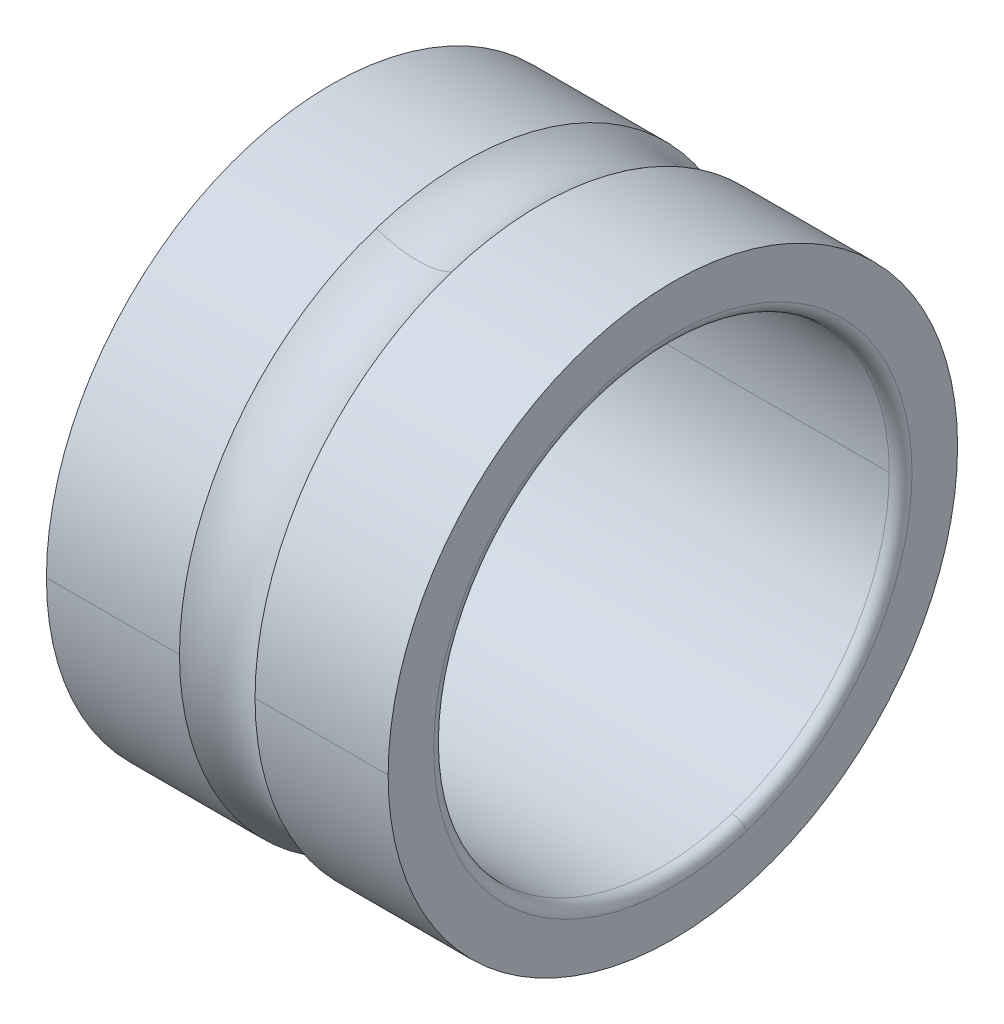
ISO-10303-21;
HEADER;
FILE_DESCRIPTION(('STEP AP214'),'2;1');
FILE_NAME('part.step','',(''),(''),'','','');
FILE_SCHEMA(('AUTOMOTIVE_DESIGN { 1 0 10303 214 1 1 1 1 }'));
ENDSEC;
DATA;
#1=APPLICATION_CONTEXT('core data for automotive mechanical design processes');
#2=APPLICATION_PROTOCOL_DEFINITION('international standard','automotive_design',2000,#1);
#3=PRODUCT_CONTEXT('',#1,'mechanical');
#4=PRODUCT('Part','Part','',(#3));
#5=PRODUCT_RELATED_PRODUCT_CATEGORY('part','',(#4));
#6=PRODUCT_DEFINITION_FORMATION('','',#4);
#7=PRODUCT_DEFINITION_CONTEXT('part definition',#1,'design');
#8=PRODUCT_DEFINITION('design','',#6,#7);
#9=PRODUCT_DEFINITION_SHAPE('','',#8);
#10=(LENGTH_UNIT() NAMED_UNIT(*) SI_UNIT(.MILLI.,.METRE.));
#11=(NAMED_UNIT(*) PLANE_ANGLE_UNIT() SI_UNIT($,.RADIAN.));
#12=(NAMED_UNIT(*) SI_UNIT($,.STERADIAN.) SOLID_ANGLE_UNIT());
#13=UNCERTAINTY_MEASURE_WITH_UNIT(LENGTH_MEASURE(1.E-05),#10,'distance_accuracy_value','');
#14=(GEOMETRIC_REPRESENTATION_CONTEXT(3) GLOBAL_UNCERTAINTY_ASSIGNED_CONTEXT((#13)) GLOBAL_UNIT_ASSIGNED_CONTEXT((#10,
#11,#12)) REPRESENTATION_CONTEXT('',''));
#15=CARTESIAN_POINT('',(0.,0.,0.));
#16=DIRECTION('',(0.,0.,1.));
#17=DIRECTION('',(1.,0.,0.));
#18=AXIS2_PLACEMENT_3D('',#15,#16,#17);
#19=CARTESIAN_POINT('',(0.,2.5,0.));
#20=DIRECTION('',(-1.,0.,0.));
#21=DIRECTION('',(0.,0.,1.));
#22=AXIS2_PLACEMENT_3D('',#19,#20,#21);
#23=PLANE('',#22);
#24=CARTESIAN_POINT('',(0.,0.,0.));
#25=DIRECTION('',(1.,0.,0.));
#26=DIRECTION('',(0.,0.,-1.));
#27=AXIS2_PLACEMENT_3D('',#24,#25,#26);
#28=CIRCLE('',#27,2.1);
#29=CARTESIAN_POINT('',(0.,1.99721868421975,0.648935688187366));
#30=VERTEX_POINT('',#29);
#31=CARTESIAN_POINT('',(0.,-1.99721868421975,-0.648935688187366));
#32=VERTEX_POINT('',#31);
#33=EDGE_CURVE('E11',#30,#32,#28,.T.);
#34=ORIENTED_EDGE('',*,*,#33,.T.);
#35=CARTESIAN_POINT('',(0.,-1.99721868421982,-0.648935688187389));
#36=CARTESIAN_POINT('',(0.,-1.79315843574684,-1.27610142852603));
#37=CARTESIAN_POINT('',(0.,-1.34391082026572,-1.82492631831534));
#38=CARTESIAN_POINT('',(0.,-0.686083016260852,-2.15925279936392));
#39=CARTESIAN_POINT('',(0.,0.728797998933005,-2.24300960324237));
#40=CARTESIAN_POINT('',(0.,1.8242297711444,-1.34360273103063));
#41=CARTESIAN_POINT('',(0.,2.15991146894551,-0.686465444450743));
#42=CARTESIAN_POINT('',(0.,2.20076924824294,0.0216043413321269));
#43=CARTESIAN_POINT('',(0.,1.99721868421982,0.648935688187389));
#44=B_SPLINE_CURVE_WITH_KNOTS('',5,(#35,#36,#37,#38,#39,#40,#41,#42,#43),.UNSPECIFIED.,.F.,.F.,
(6,3,6),(0.,1.5707963267949,3.14159265358979),.UNSPECIFIED.);
#45=EDGE_CURVE('E26',#32,#30,#44,.T.);
#46=ORIENTED_EDGE('',*,*,#45,.T.);
#47=EDGE_LOOP('',(#34,#46));
#48=FACE_BOUND('',#47,.T.);
#49=CARTESIAN_POINT('',(0.,0.,0.));
#50=DIRECTION('',(1.,0.,0.));
#51=DIRECTION('',(0.,0.,-1.));
#52=AXIS2_PLACEMENT_3D('',#49,#50,#51);
#53=CIRCLE('',#52,2.5);
#54=CARTESIAN_POINT('',(0.,0.,2.5));
#55=VERTEX_POINT('',#54);
#56=CARTESIAN_POINT('',(0.,0.,-2.5));
#57=VERTEX_POINT('',#56);
#58=EDGE_CURVE('E318',#55,#57,#53,.T.);
#59=ORIENTED_EDGE('',*,*,#58,.F.);
#60=CARTESIAN_POINT('',(0.,0.,0.));
#61=DIRECTION('',(1.,0.,0.));
#62=DIRECTION('',(0.,0.,-1.));
#63=AXIS2_PLACEMENT_3D('',#60,#61,#62);
#64=CIRCLE('',#63,2.5);
#65=EDGE_CURVE('E313',#57,#55,#64,.T.);
#66=ORIENTED_EDGE('',*,*,#65,.F.);
#67=EDGE_LOOP('',(#59,#66));
#68=FACE_BOUND('',#67,.T.);
#69=ADVANCED_FACE('F17',(#48,#68),#23,.T.);
#70=CARTESIAN_POINT('',(3.,0.,0.));
#71=DIRECTION('',(1.,0.,0.));
#72=DIRECTION('',(0.,-1.,0.));
#73=AXIS2_PLACEMENT_3D('',#70,#71,#72);
#74=CYLINDRICAL_SURFACE('',#73,2.5);
#75=DIRECTION('',(1.,0.,0.));
#76=VECTOR('',#75,1.);
#77=CARTESIAN_POINT('',(0.,0.,2.5));
#78=LINE('',#77,#76);
#79=CARTESIAN_POINT('',(1.1683375209645,0.,2.5));
#80=VERTEX_POINT('',#79);
#81=EDGE_CURVE('E309',#55,#80,#78,.T.);
#82=ORIENTED_EDGE('',*,*,#81,.T.);
#83=CARTESIAN_POINT('',(1.1683375209645,0.,0.));
#84=DIRECTION('',(1.,0.,0.));
#85=DIRECTION('',(0.,0.,-1.));
#86=AXIS2_PLACEMENT_3D('',#83,#84,#85);
#87=CIRCLE('',#86,2.5);
#88=CARTESIAN_POINT('',(1.1683375209645,2.37764129073788,0.772542485937368));
#89=VERTEX_POINT('',#88);
#90=EDGE_CURVE('E304',#89,#80,#87,.T.);
#91=ORIENTED_EDGE('',*,*,#90,.F.);
#92=CARTESIAN_POINT('',(1.1683375209645,0.,0.));
#93=DIRECTION('',(1.,0.,0.));
#94=DIRECTION('',(0.,0.,-1.));
#95=AXIS2_PLACEMENT_3D('',#92,#93,#94);
#96=CIRCLE('',#95,2.5);
#97=CARTESIAN_POINT('',(1.1683375209645,0.,-2.5));
#98=VERTEX_POINT('',#97);
#99=EDGE_CURVE('E299',#98,#89,#96,.T.);
#100=ORIENTED_EDGE('',*,*,#99,.F.);
#101=DIRECTION('',(1.,0.,0.));
#102=VECTOR('',#101,1.);
#103=CARTESIAN_POINT('',(0.,0.,-2.5));
#104=LINE('',#103,#102);
#105=EDGE_CURVE('E294',#57,#98,#104,.T.);
#106=ORIENTED_EDGE('',*,*,#105,.F.);
#107=ORIENTED_EDGE('',*,*,#65,.T.);
#108=EDGE_LOOP('',(#82,#91,#100,#106,#107));
#109=FACE_BOUND('',#108,.T.);
#110=ADVANCED_FACE('F339',(#109),#74,.T.);
#111=CARTESIAN_POINT('',(3.,0.,0.));
#112=DIRECTION('',(1.,0.,0.));
#113=DIRECTION('',(0.,1.,0.));
#114=AXIS2_PLACEMENT_3D('',#111,#112,#113);
#115=CYLINDRICAL_SURFACE('',#114,2.5);
#116=ORIENTED_EDGE('',*,*,#81,.F.);
#117=ORIENTED_EDGE('',*,*,#58,.T.);
#118=ORIENTED_EDGE('',*,*,#105,.T.);
#119=CARTESIAN_POINT('',(1.1683375209645,0.,0.));
#120=DIRECTION('',(1.,0.,0.));
#121=DIRECTION('',(0.,0.,-1.));
#122=AXIS2_PLACEMENT_3D('',#119,#120,#121);
#123=CIRCLE('',#122,2.5);
#124=CARTESIAN_POINT('',(1.1683375209645,-2.37764129073788,-0.772542485937368));
#125=VERTEX_POINT('',#124);
#126=EDGE_CURVE('E289',#125,#98,#123,.T.);
#127=ORIENTED_EDGE('',*,*,#126,.F.);
#128=CARTESIAN_POINT('',(1.1683375209645,0.,0.));
#129=DIRECTION('',(1.,0.,0.));
#130=DIRECTION('',(0.,0.,-1.));
#131=AXIS2_PLACEMENT_3D('',#128,#129,#130);
#132=CIRCLE('',#131,2.5);
#133=EDGE_CURVE('E284',#80,#125,#132,.T.);
#134=ORIENTED_EDGE('',*,*,#133,.F.);
#135=EDGE_LOOP('',(#116,#117,#118,#127,#134));
#136=FACE_BOUND('',#135,.T.);
#137=ADVANCED_FACE('F334',(#136),#115,.T.);
#138=CARTESIAN_POINT('',(1.5,0.,0.));
#139=DIRECTION('',(1.,0.,0.));
#140=DIRECTION('',(0.,0.309016994374947,-0.951056516295154));
#141=AXIS2_PLACEMENT_3D('',#138,#139,#140);
#142=TOROIDAL_SURFACE('',#141,2.99999999999986,0.599999999999866);
#143=CARTESIAN_POINT('',(1.5,-2.85316954888533,-0.9270509831248));
#144=DIRECTION('',(0.,0.309016994374947,-0.951056516295154));
#145=DIRECTION('',(-0.552770798392623,0.792547096912593,0.257514161979111));
#146=AXIS2_PLACEMENT_3D('',#143,#144,#145);
#147=CIRCLE('',#146,0.599999999999866);
#148=CARTESIAN_POINT('',(1.8316624790355,-2.37764129073788,-0.772542485937368));
#149=VERTEX_POINT('',#148);
#150=EDGE_CURVE('E280',#125,#149,#147,.T.);
#151=ORIENTED_EDGE('',*,*,#150,.T.);
#152=CARTESIAN_POINT('',(1.8316624790355,0.,0.));
#153=DIRECTION('',(1.,0.,0.));
#154=DIRECTION('',(0.,0.,-1.));
#155=AXIS2_PLACEMENT_3D('',#152,#153,#154);
#156=CIRCLE('',#155,2.5);
#157=CARTESIAN_POINT('',(1.8316624790355,0.,2.5));
#158=VERTEX_POINT('',#157);
#159=EDGE_CURVE('E275',#158,#149,#156,.T.);
#160=ORIENTED_EDGE('',*,*,#159,.F.);
#161=CARTESIAN_POINT('',(1.8316624790355,0.,0.));
#162=DIRECTION('',(1.,0.,0.));
#163=DIRECTION('',(0.,0.,-1.));
#164=AXIS2_PLACEMENT_3D('',#161,#162,#163);
#165=CIRCLE('',#164,2.5);
#166=CARTESIAN_POINT('',(1.8316624790355,2.37764129073788,0.772542485937368));
#167=VERTEX_POINT('',#166);
#168=EDGE_CURVE('E270',#167,#158,#165,.T.);
#169=ORIENTED_EDGE('',*,*,#168,.F.);
#170=CARTESIAN_POINT('',(1.5,2.85316954888533,0.9270509831248));
#171=DIRECTION('',(0.,-0.309016994374947,0.951056516295154));
#172=DIRECTION('',(-0.552770798392623,-0.792547096912593,-0.257514161979111));
#173=AXIS2_PLACEMENT_3D('',#170,#171,#172);
#174=CIRCLE('',#173,0.599999999999866);
#175=EDGE_CURVE('E265',#89,#167,#174,.T.);
#176=ORIENTED_EDGE('',*,*,#175,.F.);
#177=ORIENTED_EDGE('',*,*,#90,.T.);
#178=ORIENTED_EDGE('',*,*,#133,.T.);
#179=EDGE_LOOP('',(#151,#160,#169,#176,#177,#178));
#180=FACE_BOUND('',#179,.T.);
#181=ADVANCED_FACE('F346',(#180),#142,.F.);
#182=CARTESIAN_POINT('',(1.5,0.,0.));
#183=DIRECTION('',(1.,0.,0.));
#184=DIRECTION('',(0.,-0.309016994374947,0.951056516295154));
#185=AXIS2_PLACEMENT_3D('',#182,#183,#184);
#186=TOROIDAL_SURFACE('',#185,2.99999999999986,0.599999999999866);
#187=ORIENTED_EDGE('',*,*,#150,.F.);
#188=ORIENTED_EDGE('',*,*,#126,.T.);
#189=ORIENTED_EDGE('',*,*,#99,.T.);
#190=ORIENTED_EDGE('',*,*,#175,.T.);
#191=CARTESIAN_POINT('',(1.8316624790355,0.,0.));
#192=DIRECTION('',(1.,0.,0.));
#193=DIRECTION('',(0.,0.,-1.));
#194=AXIS2_PLACEMENT_3D('',#191,#192,#193);
#195=CIRCLE('',#194,2.5);
#196=CARTESIAN_POINT('',(1.8316624790355,0.,-2.5));
#197=VERTEX_POINT('',#196);
#198=EDGE_CURVE('E260',#197,#167,#195,.T.);
#199=ORIENTED_EDGE('',*,*,#198,.F.);
#200=CARTESIAN_POINT('',(1.8316624790355,0.,0.));
#201=DIRECTION('',(1.,0.,0.));
#202=DIRECTION('',(0.,0.,-1.));
#203=AXIS2_PLACEMENT_3D('',#200,#201,#202);
#204=CIRCLE('',#203,2.5);
#205=EDGE_CURVE('E255',#149,#197,#204,.T.);
#206=ORIENTED_EDGE('',*,*,#205,.F.);
#207=EDGE_LOOP('',(#187,#188,#189,#190,#199,#206));
#208=FACE_BOUND('',#207,.T.);
#209=ADVANCED_FACE('F343',(#208),#186,.F.);
#210=CARTESIAN_POINT('',(3.,0.,0.));
#211=DIRECTION('',(1.,0.,0.));
#212=DIRECTION('',(0.,1.,0.));
#213=AXIS2_PLACEMENT_3D('',#210,#211,#212);
#214=CYLINDRICAL_SURFACE('',#213,2.5);
#215=DIRECTION('',(1.,0.,0.));
#216=VECTOR('',#215,1.);
#217=CARTESIAN_POINT('',(1.8316624790355,0.,2.5));
#218=LINE('',#217,#216);
#219=CARTESIAN_POINT('',(3.,0.,2.5));
#220=VERTEX_POINT('',#219);
#221=EDGE_CURVE('E250',#158,#220,#218,.T.);
#222=ORIENTED_EDGE('',*,*,#221,.F.);
#223=ORIENTED_EDGE('',*,*,#159,.T.);
#224=ORIENTED_EDGE('',*,*,#205,.T.);
#225=DIRECTION('',(1.,0.,0.));
#226=VECTOR('',#225,1.);
#227=CARTESIAN_POINT('',(1.8316624790355,0.,-2.5));
#228=LINE('',#227,#226);
#229=CARTESIAN_POINT('',(3.,0.,-2.5));
#230=VERTEX_POINT('',#229);
#231=EDGE_CURVE('E246',#197,#230,#228,.T.);
#232=ORIENTED_EDGE('',*,*,#231,.T.);
#233=CARTESIAN_POINT('',(3.,0.,0.));
#234=DIRECTION('',(1.,0.,0.));
#235=DIRECTION('',(0.,0.,-1.));
#236=AXIS2_PLACEMENT_3D('',#233,#234,#235);
#237=CIRCLE('',#236,2.5);
#238=EDGE_CURVE('E241',#220,#230,#237,.T.);
#239=ORIENTED_EDGE('',*,*,#238,.F.);
#240=EDGE_LOOP('',(#222,#223,#224,#232,#239));
#241=FACE_BOUND('',#240,.T.);
#242=ADVANCED_FACE('F353',(#241),#214,.T.);
#243=CARTESIAN_POINT('',(3.,2.1,0.));
#244=DIRECTION('',(1.,0.,0.));
#245=DIRECTION('',(0.,0.,-1.));
#246=AXIS2_PLACEMENT_3D('',#243,#244,#245);
#247=PLANE('',#246);
#248=CARTESIAN_POINT('',(3.,0.,0.));
#249=DIRECTION('',(1.,0.,0.));
#250=DIRECTION('',(0.,0.,-1.));
#251=AXIS2_PLACEMENT_3D('',#248,#249,#250);
#252=CIRCLE('',#251,2.5);
#253=EDGE_CURVE('E238',#230,#220,#252,.T.);
#254=ORIENTED_EDGE('',*,*,#253,.T.);
#255=ORIENTED_EDGE('',*,*,#238,.T.);
#256=EDGE_LOOP('',(#254,#255));
#257=FACE_BOUND('',#256,.T.);
#258=CARTESIAN_POINT('',(3.,-1.99721868421967,-0.648935688187345));
#259=CARTESIAN_POINT('',(3.,-1.98660118134118,-0.681615360728426));
#260=CARTESIAN_POINT('',(3.,-1.97518026238297,-0.714033922348104));
#261=CARTESIAN_POINT('',(3.,-1.95076210129556,-0.77827186302954));
#262=CARTESIAN_POINT('',(3.,-1.93776485916635,-0.810091242091297));
#263=CARTESIAN_POINT('',(3.,-1.91022456072533,-0.873053856941777));
#264=CARTESIAN_POINT('',(3.,-1.89568150441353,-0.904197092730499));
#265=CARTESIAN_POINT('',(3.,-1.86508482813472,-0.965732475988335));
#266=CARTESIAN_POINT('',(3.,-1.84903120816771,-0.99612462345745));
#267=CARTESIAN_POINT('',(3.,-1.81545202153776,-1.05608459082961));
#268=CARTESIAN_POINT('',(3.,-1.79792645487483,-1.08565241073266));
#269=CARTESIAN_POINT('',(3.,-1.76144561091669,-1.14389249737312));
#270=CARTESIAN_POINT('',(3.,-1.7424903336215,-1.17256476411052));
#271=CARTESIAN_POINT('',(3.,-1.7031957291854,-1.22894466884528));
#272=CARTESIAN_POINT('',(3.,-1.6828564020445,-1.25665230684264));
#273=CARTESIAN_POINT('',(3.,-1.64084269824602,-1.31103620439181));
#274=CARTESIAN_POINT('',(3.,-1.61916832158845,-1.33771246394361));
#275=CARTESIAN_POINT('',(3.,-1.57453673393144,-1.38996933904296));
#276=CARTESIAN_POINT('',(3.,-1.55157952293201,-1.4155499545905));
#277=CARTESIAN_POINT('',(3.,-1.50443757260298,-1.4655539157681));
#278=CARTESIAN_POINT('',(3.,-1.48025283327338,-1.48997726139817));
#279=CARTESIAN_POINT('',(3.,-1.43071408941807,-1.53760784475387));
#280=CARTESIAN_POINT('',(3.,-1.40536008489237,-1.5608150824795));
#281=CARTESIAN_POINT('',(3.,-1.3535438906682,-1.60595754176012));
#282=CARTESIAN_POINT('',(3.,-1.32708170096975,-1.6278927633151));
#283=CARTESIAN_POINT('',(3.,-1.27311288613136,-1.67043834638379));
#284=CARTESIAN_POINT('',(3.,-1.24560626099143,-1.69104870789751));
#285=CARTESIAN_POINT('',(3.,-1.18961484113975,-1.7308949187177));
#286=CARTESIAN_POINT('',(3.,-1.161130046428,-1.75013076802417));
#287=CARTESIAN_POINT('',(3.,-1.10325090979803,-1.78718161358398));
#288=CARTESIAN_POINT('',(3.,-1.0738565678798,-1.80499660983732));
#289=CARTESIAN_POINT('',(3.,-1.0142291503812,-1.8391628314045));
#290=CARTESIAN_POINT('',(3.,-0.983996074800828,-1.85551405671834));
#291=CARTESIAN_POINT('',(3.,-0.922764024105125,-1.88671334487253));
#292=CARTESIAN_POINT('',(3.,-0.891765048989791,-1.90156140771289));
#293=CARTESIAN_POINT('',(3.,-0.8290758784704,-1.9297186006362));
#294=CARTESIAN_POINT('',(3.,-0.797385683066344,-1.94302773071915));
#295=CARTESIAN_POINT('',(3.,-0.73339041642597,-1.96807499526754));
#296=CARTESIAN_POINT('',(3.,-0.701085345189653,-1.97981312973298));
#297=CARTESIAN_POINT('',(3.,-0.635938152630957,-2.00169012485227));
#298=CARTESIAN_POINT('',(3.,-0.603096031308577,-2.01182898550613));
#299=CARTESIAN_POINT('',(3.,-0.536953858124651,-2.03048300759889));
#300=CARTESIAN_POINT('',(3.,-0.503653806263105,-2.03899816903779));
#301=CARTESIAN_POINT('',(3.,-0.43667599474252,-2.05438427893089));
#302=CARTESIAN_POINT('',(3.,-0.402998235083482,-2.0612552273851));
#303=CARTESIAN_POINT('',(3.,-0.335346140640755,-2.07333635859214));
#304=CARTESIAN_POINT('',(3.,-0.301371805857066,-2.07854654134499));
#305=CARTESIAN_POINT('',(3.,-0.233208408313332,-2.08729358936273));
#306=CARTESIAN_POINT('',(3.,-0.199019345553287,-2.09083045462762));
#307=CARTESIAN_POINT('',(3.,-0.130508856503638,-2.09622234705121));
#308=CARTESIAN_POINT('',(3.,-0.0961874302140345,-2.09807737420992));
#309=CARTESIAN_POINT('',(3.,-0.0274948974274021,-2.10010112149826));
#310=CARTESIAN_POINT('',(3.,0.0068762090696264,-2.10026984162788));
#311=CARTESIAN_POINT('',(3.,0.0755852992650046,-2.09892056839648));
#312=CARTESIAN_POINT('',(3.,0.109923282963354,-2.09740257503545));
#313=CARTESIAN_POINT('',(3.,0.178483404350992,-2.09268353180171));
#314=CARTESIAN_POINT('',(3.,0.212705542040281,-2.08948248192899));
#315=CARTESIAN_POINT('',(3.,0.280951527282598,-2.08140503728139));
#316=CARTESIAN_POINT('',(3.,0.314975374835626,-2.07652864250651));
#317=CARTESIAN_POINT('',(3.,0.382742813376533,-2.06511225571672));
#318=CARTESIAN_POINT('',(3.,0.41648640436441,-2.05857226370181));
#319=CARTESIAN_POINT('',(3.,0.483612038508733,-2.04384443784555));
#320=CARTESIAN_POINT('',(3.,0.516994081665179,-2.03565660400421));
#321=CARTESIAN_POINT('',(3.,0.583316199880754,-2.01765281970399));
#322=CARTESIAN_POINT('',(3.,0.616256274939883,-2.00783686924511));
#323=CARTESIAN_POINT('',(3.,0.681615101434796,-1.98660049919424));
#324=CARTESIAN_POINT('',(3.,0.714033852870581,-1.97518007960226));
#325=CARTESIAN_POINT('',(3.,0.778271932507051,-1.95076228407628));
#326=CARTESIAN_POINT('',(3.,0.810091260707736,-1.9377649081423));
#327=CARTESIAN_POINT('',(3.,0.873053838325327,-1.91022451174939));
#328=CARTESIAN_POINT('',(3.,0.904197087742232,-1.89568149129047));
#329=CARTESIAN_POINT('',(3.,0.965732480976592,-1.86508484125779));
#330=CARTESIAN_POINT('',(3.,0.996124624794046,-1.84903121168403));
#331=CARTESIAN_POINT('',(3.,1.05608458949301,-1.81545201802145));
#332=CARTESIAN_POINT('',(3.,1.08565241037452,-1.79792645393264));
#333=CARTESIAN_POINT('',(3.,1.14389249773125,-1.76144561185889));
#334=CARTESIAN_POINT('',(3.,1.17256476420648,-1.74249033387396));
#335=CARTESIAN_POINT('',(3.,1.22894466874931,-1.70319572893294));
#336=CARTESIAN_POINT('',(3.,1.25665230681692,-1.68285640197686));
#337=CARTESIAN_POINT('',(3.,1.31103620441751,-1.64084269831367));
#338=CARTESIAN_POINT('',(3.,1.3377124639505,-1.61916832160658));
#339=CARTESIAN_POINT('',(3.,1.38996933903607,-1.57453673391332));
#340=CARTESIAN_POINT('',(3.,1.41554995458865,-1.55157952292716));
#341=CARTESIAN_POINT('',(3.,1.46555391576994,-1.50443757260784));
#342=CARTESIAN_POINT('',(3.,1.48997726139866,-1.48025283327469));
#343=CARTESIAN_POINT('',(3.,1.53760784475337,-1.43071408941678));
#344=CARTESIAN_POINT('',(3.,1.56081508247937,-1.40536008489202));
#345=CARTESIAN_POINT('',(3.,1.60595754176025,-1.35354389066856));
#346=CARTESIAN_POINT('',(3.,1.62789276331513,-1.32708170096985));
#347=CARTESIAN_POINT('',(3.,1.67043834638375,-1.27311288613127));
#348=CARTESIAN_POINT('',(3.,1.6910487078975,-1.24560626099141));
#349=CARTESIAN_POINT('',(3.,1.7308949187177,-1.18961484113978));
#350=CARTESIAN_POINT('',(3.,1.75013076802417,-1.16113004642802));
#351=CARTESIAN_POINT('',(3.,1.78718161358397,-1.10325090979803));
#352=CARTESIAN_POINT('',(3.,1.80499660983731,-1.0738565678798));
#353=CARTESIAN_POINT('',(3.,1.8391628314045,-1.0142291503812));
#354=CARTESIAN_POINT('',(3.,1.85551405671834,-0.983996074800835));
#355=CARTESIAN_POINT('',(3.,1.88671334487253,-0.922764024105131));
#356=CARTESIAN_POINT('',(3.,1.90156140771288,-0.891765048989797));
#357=CARTESIAN_POINT('',(3.,1.92971860063619,-0.829075878470405));
#358=CARTESIAN_POINT('',(3.,1.94302773071915,-0.797385683066348));
#359=CARTESIAN_POINT('',(3.,1.96807499526753,-0.733390416425978));
#360=CARTESIAN_POINT('',(3.,1.97981312973295,-0.701085345189666));
#361=CARTESIAN_POINT('',(3.,2.0016901248523,-0.635938152630955));
#362=CARTESIAN_POINT('',(3.,2.01182898550623,-0.603096031308556));
#363=CARTESIAN_POINT('',(3.,2.03048300759879,-0.536953858124683));
#364=CARTESIAN_POINT('',(3.,2.03899816903743,-0.503653806263208));
#365=CARTESIAN_POINT('',(3.,2.05438427893125,-0.436675994742428));
#366=CARTESIAN_POINT('',(3.,2.06125522738644,-0.402998235083122));
#367=CARTESIAN_POINT('',(3.,2.0733363585908,-0.335346140641125));
#368=CARTESIAN_POINT('',(3.,2.07854654133998,-0.301371805858433));
#369=CARTESIAN_POINT('',(3.,2.08729358936774,-0.233208408311977));
#370=CARTESIAN_POINT('',(3.,2.09083045464633,-0.199019345548213));
#371=CARTESIAN_POINT('',(3.,2.0962223470325,-0.130508856508725));
#372=CARTESIAN_POINT('',(3.,2.09807737414008,-0.0961874302330008));
#373=CARTESIAN_POINT('',(3.,2.1001011215681,-0.0274948974084504));
#374=CARTESIAN_POINT('',(3.,2.10026984188853,0.00687620914037546));
#375=CARTESIAN_POINT('',(3.,2.09892056813583,0.0755852991942415));
#376=CARTESIAN_POINT('',(3.,2.09740257406269,0.109923282699282));
#377=CARTESIAN_POINT('',(3.,2.09268353277447,0.178483404615051));
#378=CARTESIAN_POINT('',(3.,2.08948248555938,0.21270554302578));
#379=CARTESIAN_POINT('',(3.,2.081405033651,0.280951526297087));
#380=CARTESIAN_POINT('',(3.,2.0765286289577,0.314975371157666));
#381=CARTESIAN_POINT('',(3.,2.06511226926553,0.382742817054484));
#382=CARTESIAN_POINT('',(3.,2.05857231426665,0.416486418090724));
#383=CARTESIAN_POINT('',(3.,2.04384438728071,0.483612024782408));
#384=CARTESIAN_POINT('',(3.,2.03565641529364,0.516994030437853));
#385=CARTESIAN_POINT('',(3.,2.01765300841456,0.583316251108068));
#386=CARTESIAN_POINT('',(3.,2.00783757352255,0.616256466122839));
#387=CARTESIAN_POINT('',(3.,1.99721868421968,0.648935688187334));
#388=B_SPLINE_CURVE_WITH_KNOTS('',3,(#258,#259,#260,#261,#262,#263,#264,#265,#266,#267,#268,
#269,#270,#271,#272,#273,#274,#275,#276,#277,#278,#279,#280,#281,#282,#283,#284,#285,#286,#287,
#288,#289,#290,#291,#292,#293,#294,#295,#296,#297,#298,#299,#300,#301,#302,#303,#304,#305,#306,
#307,#308,#309,#310,#311,#312,#313,#314,#315,#316,#317,#318,#319,#320,#321,#322,#323,#324,#325,
#326,#327,#328,#329,#330,#331,#332,#333,#334,#335,#336,#337,#338,#339,#340,#341,#342,#343,#344,
#345,#346,#347,#348,#349,#350,#351,#352,#353,#354,#355,#356,#357,#358,#359,#360,#361,#362,#363,
#364,#365,#366,#367,#368,#369,#370,#371,#372,#373,#374,#375,#376,#377,#378,#379,#380,#381,#382,
#383,#384,#385,#386,#387),.UNSPECIFIED.,.F.,.F.,(4,2,2,2,2,2,2,2,2,2,2,2,2,2,2,2,2,2,2,2,2,2,2,
2,2,2,2,2,2,2,2,2,2,2,2,2,2,2,2,2,2,2,2,2,2,2,2,2,2,2,2,2,2,2,2,2,2,2,2,2,2,2,2,2,4),(0.,
0.103073159796224,0.206146319592448,0.309219479388672,0.412292639184895,0.515365798981119,
0.618438958777343,0.721512118573566,0.824585278369791,0.927658438166014,1.03073159796224,
1.13380475775846,1.23687791755469,1.33995107735091,1.44302423714713,1.54609739694336,
1.64917055673958,1.75224371653581,1.85531687633203,1.95839003612825,2.06146319592448,
2.1645363557207,2.26760951551692,2.37068267531315,2.47375583510937,2.5768289949056,
2.67990215470182,2.78297531449804,2.88604847429427,2.98912163409049,3.09219479388671,
3.19526795368294,3.29834111347916,3.40141427327538,3.50448743307161,3.60756059286783,
3.71063375266406,3.81370691246028,3.91678007225651,4.01985323205273,4.12292639184895,
4.22599955164518,4.3290727114414,4.43214587123762,4.53521903103385,4.63829219083007,
4.74136535062629,4.84443851042252,4.94751167021874,5.05058483001497,5.15365798981119,
5.25673114960741,5.35980430940364,5.46287746919986,5.56595062899608,5.66902378879231,
5.77209694858853,5.87517010838475,5.97824326818098,6.0813164279772,6.18438958777343,
6.28746274756965,6.39053590736587,6.4936090671621,6.59668222695832),.UNSPECIFIED.);
#389=CARTESIAN_POINT('',(3.,-1.99721868421968,-0.648935688187341));
#390=VERTEX_POINT('',#389);
#391=CARTESIAN_POINT('',(3.,1.99721868421968,0.648935688187342));
#392=VERTEX_POINT('',#391);
#393=EDGE_CURVE('E237',#390,#392,#388,.T.);
#394=ORIENTED_EDGE('',*,*,#393,.F.);
#395=CARTESIAN_POINT('',(3.,1.99721868421967,0.648935688187345));
#396=CARTESIAN_POINT('',(3.,1.98660118134118,0.681615360728426));
#397=CARTESIAN_POINT('',(3.,1.97518026238297,0.714033922348104));
#398=CARTESIAN_POINT('',(3.,1.95076210129556,0.77827186302954));
#399=CARTESIAN_POINT('',(3.,1.93776485916635,0.810091242091297));
#400=CARTESIAN_POINT('',(3.,1.91022456072533,0.873053856941777));
#401=CARTESIAN_POINT('',(3.,1.89568150441353,0.904197092730499));
#402=CARTESIAN_POINT('',(3.,1.86508482813472,0.965732475988336));
#403=CARTESIAN_POINT('',(3.,1.84903120816771,0.996124623457451));
#404=CARTESIAN_POINT('',(3.,1.81545202153776,1.05608459082961));
#405=CARTESIAN_POINT('',(3.,1.79792645487483,1.08565241073266));
#406=CARTESIAN_POINT('',(3.,1.76144561091669,1.14389249737312));
#407=CARTESIAN_POINT('',(3.,1.7424903336215,1.17256476411052));
#408=CARTESIAN_POINT('',(3.,1.7031957291854,1.22894466884528));
#409=CARTESIAN_POINT('',(3.,1.6828564020445,1.25665230684264));
#410=CARTESIAN_POINT('',(3.,1.64084269824602,1.31103620439181));
#411=CARTESIAN_POINT('',(3.,1.61916832158845,1.33771246394361));
#412=CARTESIAN_POINT('',(3.,1.57453673393144,1.38996933904296));
#413=CARTESIAN_POINT('',(3.,1.55157952293201,1.4155499545905));
#414=CARTESIAN_POINT('',(3.,1.50443757260298,1.4655539157681));
#415=CARTESIAN_POINT('',(3.,1.48025283327338,1.48997726139817));
#416=CARTESIAN_POINT('',(3.,1.43071408941807,1.53760784475387));
#417=CARTESIAN_POINT('',(3.,1.40536008489236,1.5608150824795));
#418=CARTESIAN_POINT('',(3.,1.3535438906682,1.60595754176012));
#419=CARTESIAN_POINT('',(3.,1.32708170096975,1.6278927633151));
#420=CARTESIAN_POINT('',(3.,1.27311288613136,1.67043834638379));
#421=CARTESIAN_POINT('',(3.,1.24560626099143,1.69104870789751));
#422=CARTESIAN_POINT('',(3.,1.18961484113975,1.7308949187177));
#423=CARTESIAN_POINT('',(3.,1.161130046428,1.75013076802417));
#424=CARTESIAN_POINT('',(3.,1.10325090979803,1.78718161358398));
#425=CARTESIAN_POINT('',(3.,1.0738565678798,1.80499660983732));
#426=CARTESIAN_POINT('',(3.,1.0142291503812,1.8391628314045));
#427=CARTESIAN_POINT('',(3.,0.983996074800827,1.85551405671834));
#428=CARTESIAN_POINT('',(3.,0.922764024105125,1.88671334487253));
#429=CARTESIAN_POINT('',(3.,0.89176504898979,1.90156140771289));
#430=CARTESIAN_POINT('',(3.,0.829075878470399,1.9297186006362));
#431=CARTESIAN_POINT('',(3.,0.797385683066343,1.94302773071915));
#432=CARTESIAN_POINT('',(3.,0.733390416425969,1.96807499526754));
#433=CARTESIAN_POINT('',(3.,0.701085345189651,1.97981312973298));
#434=CARTESIAN_POINT('',(3.,0.635938152630954,2.00169012485227));
#435=CARTESIAN_POINT('',(3.,0.603096031308575,2.01182898550613));
#436=CARTESIAN_POINT('',(3.,0.536953858124649,2.03048300759889));
#437=CARTESIAN_POINT('',(3.,0.503653806263103,2.03899816903779));
#438=CARTESIAN_POINT('',(3.,0.436675994742517,2.0543842789309));
#439=CARTESIAN_POINT('',(3.,0.402998235083478,2.0612552273851));
#440=CARTESIAN_POINT('',(3.,0.335346140640751,2.07333635859215));
#441=CARTESIAN_POINT('',(3.,0.301371805857062,2.07854654134499));
#442=CARTESIAN_POINT('',(3.,0.233208408313329,2.08729358936273));
#443=CARTESIAN_POINT('',(3.,0.199019345553284,2.09083045462762));
#444=CARTESIAN_POINT('',(3.,0.130508856503636,2.09622234705121));
#445=CARTESIAN_POINT('',(3.,0.0961874302140322,2.09807737420992));
#446=CARTESIAN_POINT('',(3.,0.0274948974273998,2.10010112149826));
#447=CARTESIAN_POINT('',(3.,-0.006876209069629,2.10026984162788));
#448=CARTESIAN_POINT('',(3.,-0.0755852992650073,2.09892056839648));
#449=CARTESIAN_POINT('',(3.,-0.109923282963357,2.09740257503545));
#450=CARTESIAN_POINT('',(3.,-0.178483404350995,2.09268353180171));
#451=CARTESIAN_POINT('',(3.,-0.212705542040283,2.08948248192899));
#452=CARTESIAN_POINT('',(3.,-0.280951527282601,2.08140503728139));
#453=CARTESIAN_POINT('',(3.,-0.314975374835629,2.07652864250651));
#454=CARTESIAN_POINT('',(3.,-0.382742813376536,2.06511225571672));
#455=CARTESIAN_POINT('',(3.,-0.416486404364413,2.05857226370181));
#456=CARTESIAN_POINT('',(3.,-0.483612038508736,2.04384443784555));
#457=CARTESIAN_POINT('',(3.,-0.516994081665182,2.03565660400421));
#458=CARTESIAN_POINT('',(3.,-0.583316199880757,2.01765281970399));
#459=CARTESIAN_POINT('',(3.,-0.616256274939886,2.00783686924511));
#460=CARTESIAN_POINT('',(3.,-0.6816151014348,1.98660049919424));
#461=CARTESIAN_POINT('',(3.,-0.714033852870585,1.97518007960225));
#462=CARTESIAN_POINT('',(3.,-0.778271932507055,1.95076228407628));
#463=CARTESIAN_POINT('',(3.,-0.81009126070774,1.9377649081423));
#464=CARTESIAN_POINT('',(3.,-0.87305383832533,1.91022451174939));
#465=CARTESIAN_POINT('',(3.,-0.904197087742235,1.89568149129047));
#466=CARTESIAN_POINT('',(3.,-0.965732480976594,1.86508484125778));
#467=CARTESIAN_POINT('',(3.,-0.996124624794049,1.84903121168403));
#468=CARTESIAN_POINT('',(3.,-1.05608458949301,1.81545201802145));
#469=CARTESIAN_POINT('',(3.,-1.08565241037452,1.79792645393263));
#470=CARTESIAN_POINT('',(3.,-1.14389249773125,1.76144561185889));
#471=CARTESIAN_POINT('',(3.,-1.17256476420648,1.74249033387396));
#472=CARTESIAN_POINT('',(3.,-1.22894466874931,1.70319572893294));
#473=CARTESIAN_POINT('',(3.,-1.25665230681692,1.68285640197686));
#474=CARTESIAN_POINT('',(3.,-1.31103620441752,1.64084269831367));
#475=CARTESIAN_POINT('',(3.,-1.3377124639505,1.61916832160658));
#476=CARTESIAN_POINT('',(3.,-1.38996933903607,1.57453673391332));
#477=CARTESIAN_POINT('',(3.,-1.41554995458865,1.55157952292715));
#478=CARTESIAN_POINT('',(3.,-1.46555391576995,1.50443757260784));
#479=CARTESIAN_POINT('',(3.,-1.48997726139866,1.48025283327468));
#480=CARTESIAN_POINT('',(3.,-1.53760784475337,1.43071408941677));
#481=CARTESIAN_POINT('',(3.,-1.56081508247937,1.40536008489202));
#482=CARTESIAN_POINT('',(3.,-1.60595754176025,1.35354389066855));
#483=CARTESIAN_POINT('',(3.,-1.62789276331513,1.32708170096984));
#484=CARTESIAN_POINT('',(3.,-1.67043834638375,1.27311288613127));
#485=CARTESIAN_POINT('',(3.,-1.6910487078975,1.2456062609914));
#486=CARTESIAN_POINT('',(3.,-1.7308949187177,1.18961484113978));
#487=CARTESIAN_POINT('',(3.,-1.75013076802417,1.16113004642801));
#488=CARTESIAN_POINT('',(3.,-1.78718161358397,1.10325090979802));
#489=CARTESIAN_POINT('',(3.,-1.80499660983732,1.0738565678798));
#490=CARTESIAN_POINT('',(3.,-1.8391628314045,1.0142291503812));
#491=CARTESIAN_POINT('',(3.,-1.85551405671834,0.983996074800829));
#492=CARTESIAN_POINT('',(3.,-1.88671334487253,0.922764024105126));
#493=CARTESIAN_POINT('',(3.,-1.90156140771288,0.891765048989793));
#494=CARTESIAN_POINT('',(3.,-1.9297186006362,0.829075878470402));
#495=CARTESIAN_POINT('',(3.,-1.94302773071915,0.797385683066344));
#496=CARTESIAN_POINT('',(3.,-1.96807499526753,0.733390416425974));
#497=CARTESIAN_POINT('',(3.,-1.97981312973295,0.701085345189662));
#498=CARTESIAN_POINT('',(3.,-2.0016901248523,0.635938152630951));
#499=CARTESIAN_POINT('',(3.,-2.01182898550623,0.603096031308551));
#500=CARTESIAN_POINT('',(3.,-2.03048300759879,0.536953858124677));
#501=CARTESIAN_POINT('',(3.,-2.03899816903743,0.503653806263202));
#502=CARTESIAN_POINT('',(3.,-2.05438427893126,0.436675994742422));
#503=CARTESIAN_POINT('',(3.,-2.06125522738644,0.402998235083117));
#504=CARTESIAN_POINT('',(3.,-2.0733363585908,0.335346140641119));
#505=CARTESIAN_POINT('',(3.,-2.07854654133998,0.301371805858427));
#506=CARTESIAN_POINT('',(3.,-2.08729358936774,0.233208408311971));
#507=CARTESIAN_POINT('',(3.,-2.09083045464633,0.199019345548208));
#508=CARTESIAN_POINT('',(3.,-2.0962223470325,0.13050885650872));
#509=CARTESIAN_POINT('',(3.,-2.09807737414008,0.096187430232995));
#510=CARTESIAN_POINT('',(3.,-2.1001011215681,0.0274948974084445));
#511=CARTESIAN_POINT('',(3.,-2.10026984188853,-0.0068762091403813));
#512=CARTESIAN_POINT('',(3.,-2.09892056813583,-0.0755852991942473));
#513=CARTESIAN_POINT('',(3.,-2.09740257406269,-0.109923282699287));
#514=CARTESIAN_POINT('',(3.,-2.09268353277447,-0.178483404615057));
#515=CARTESIAN_POINT('',(3.,-2.08948248555938,-0.212705543025786));
#516=CARTESIAN_POINT('',(3.,-2.081405033651,-0.280951526297093));
#517=CARTESIAN_POINT('',(3.,-2.0765286289577,-0.314975371157671));
#518=CARTESIAN_POINT('',(3.,-2.06511226926553,-0.38274281705449));
#519=CARTESIAN_POINT('',(3.,-2.05857231426665,-0.41648641809073));
#520=CARTESIAN_POINT('',(3.,-2.04384438728071,-0.483612024782414));
#521=CARTESIAN_POINT('',(3.,-2.03565641529364,-0.516994030437858));
#522=CARTESIAN_POINT('',(3.,-2.01765300841456,-0.583316251108074));
#523=CARTESIAN_POINT('',(3.,-2.00783757352254,-0.616256466122845));
#524=CARTESIAN_POINT('',(3.,-1.99721868421968,-0.64893568818734));
#525=B_SPLINE_CURVE_WITH_KNOTS('',3,(#395,#396,#397,#398,#399,#400,#401,#402,#403,#404,#405,
#406,#407,#408,#409,#410,#411,#412,#413,#414,#415,#416,#417,#418,#419,#420,#421,#422,#423,#424,
#425,#426,#427,#428,#429,#430,#431,#432,#433,#434,#435,#436,#437,#438,#439,#440,#441,#442,#443,
#444,#445,#446,#447,#448,#449,#450,#451,#452,#453,#454,#455,#456,#457,#458,#459,#460,#461,#462,
#463,#464,#465,#466,#467,#468,#469,#470,#471,#472,#473,#474,#475,#476,#477,#478,#479,#480,#481,
#482,#483,#484,#485,#486,#487,#488,#489,#490,#491,#492,#493,#494,#495,#496,#497,#498,#499,#500,
#501,#502,#503,#504,#505,#506,#507,#508,#509,#510,#511,#512,#513,#514,#515,#516,#517,#518,#519,
#520,#521,#522,#523,#524),.UNSPECIFIED.,.F.,.F.,(4,2,2,2,2,2,2,2,2,2,2,2,2,2,2,2,2,2,2,2,2,2,2,
2,2,2,2,2,2,2,2,2,2,2,2,2,2,2,2,2,2,2,2,2,2,2,2,2,2,2,2,2,2,2,2,2,2,2,2,2,2,2,2,2,4),(0.,
0.103073159796224,0.206146319592448,0.309219479388672,0.412292639184896,0.515365798981119,
0.618438958777344,0.721512118573567,0.824585278369792,0.927658438166015,1.03073159796224,
1.13380475775846,1.23687791755469,1.33995107735091,1.44302423714713,1.54609739694336,
1.64917055673958,1.75224371653581,1.85531687633203,1.95839003612825,2.06146319592448,
2.1645363557207,2.26760951551693,2.37068267531315,2.47375583510937,2.5768289949056,
2.67990215470182,2.78297531449804,2.88604847429427,2.98912163409049,3.09219479388672,
3.19526795368294,3.29834111347916,3.40141427327539,3.50448743307161,3.60756059286784,
3.71063375266406,3.81370691246028,3.91678007225651,4.01985323205273,4.12292639184895,
4.22599955164518,4.3290727114414,4.43214587123763,4.53521903103385,4.63829219083007,
4.7413653506263,4.84443851042252,4.94751167021875,5.05058483001497,5.15365798981119,
5.25673114960742,5.35980430940364,5.46287746919986,5.56595062899609,5.66902378879231,
5.77209694858854,5.87517010838476,5.97824326818098,6.08131642797721,6.18438958777343,
6.28746274756965,6.39053590736588,6.4936090671621,6.59668222695832),.UNSPECIFIED.);
#526=EDGE_CURVE('E200',#392,#390,#525,.T.);
#527=ORIENTED_EDGE('',*,*,#526,.F.);
#528=EDGE_LOOP('',(#394,#527));
#529=FACE_BOUND('',#528,.T.);
#530=ADVANCED_FACE('F185',(#257,#529),#247,.T.);
#531=CARTESIAN_POINT('',(2.90000000000015,0.,0.));
#532=DIRECTION('',(1.,0.,0.));
#533=DIRECTION('',(0.,0.309016994374947,-0.951056516295154));
#534=AXIS2_PLACEMENT_3D('',#531,#532,#533);
#535=TOROIDAL_SURFACE('',#534,2.09999999999985,0.0999999999998467);
#536=CARTESIAN_POINT('',(2.90000000000015,-1.99721868421968,-0.648935688187341));
#537=DIRECTION('',(0.,0.309016994374947,-0.951056516295154));
#538=DIRECTION('',(-1.54987134237909E-12,0.951056516295154,0.309016994374947));
#539=AXIS2_PLACEMENT_3D('',#536,#537,#538);
#540=CIRCLE('',#539,0.0999999999998467);
#541=CARTESIAN_POINT('',(2.9,-1.90211303259031,-0.618033988749894));
#542=VERTEX_POINT('',#541);
#543=EDGE_CURVE('E211',#542,#390,#540,.T.);
#544=ORIENTED_EDGE('',*,*,#543,.F.);
#545=CARTESIAN_POINT('',(2.9,0.,0.));
#546=DIRECTION('',(1.,0.,0.));
#547=DIRECTION('',(0.,0.,-1.));
#548=AXIS2_PLACEMENT_3D('',#545,#546,#547);
#549=CIRCLE('',#548,2.);
#550=CARTESIAN_POINT('',(2.9,0.,2.));
#551=VERTEX_POINT('',#550);
#552=EDGE_CURVE('E206',#551,#542,#549,.T.);
#553=ORIENTED_EDGE('',*,*,#552,.F.);
#554=CARTESIAN_POINT('',(2.9,0.,0.));
#555=DIRECTION('',(1.,0.,0.));
#556=DIRECTION('',(0.,0.,-1.));
#557=AXIS2_PLACEMENT_3D('',#554,#555,#556);
#558=CIRCLE('',#557,2.);
#559=CARTESIAN_POINT('',(2.9,1.90211303259031,0.618033988749894));
#560=VERTEX_POINT('',#559);
#561=EDGE_CURVE('E202',#560,#551,#558,.T.);
#562=ORIENTED_EDGE('',*,*,#561,.F.);
#563=CARTESIAN_POINT('',(2.90000000000015,1.99721868421968,0.648935688187342));
#564=DIRECTION('',(0.,-0.309016994374947,0.951056516295154));
#565=DIRECTION('',(-1.54987134237909E-12,-0.951056516295154,-0.309016994374947));
#566=AXIS2_PLACEMENT_3D('',#563,#564,#565);
#567=CIRCLE('',#566,0.0999999999998467);
#568=EDGE_CURVE('E159',#560,#392,#567,.T.);
#569=ORIENTED_EDGE('',*,*,#568,.T.);
#570=ORIENTED_EDGE('',*,*,#526,.T.);
#571=EDGE_LOOP('',(#544,#553,#562,#569,#570));
#572=FACE_BOUND('',#571,.T.);
#573=ADVANCED_FACE('F179',(#572),#535,.T.);
#574=CARTESIAN_POINT('',(2.90000000000015,0.,0.));
#575=DIRECTION('',(1.,0.,0.));
#576=DIRECTION('',(0.,-0.309016994374947,0.951056516295154));
#577=AXIS2_PLACEMENT_3D('',#574,#575,#576);
#578=TOROIDAL_SURFACE('',#577,2.09999999999985,0.0999999999998467);
#579=ORIENTED_EDGE('',*,*,#543,.T.);
#580=ORIENTED_EDGE('',*,*,#393,.T.);
#581=ORIENTED_EDGE('',*,*,#568,.F.);
#582=CARTESIAN_POINT('',(2.9,0.,0.));
#583=DIRECTION('',(1.,0.,0.));
#584=DIRECTION('',(0.,0.,-1.));
#585=AXIS2_PLACEMENT_3D('',#582,#583,#584);
#586=CIRCLE('',#585,2.);
#587=CARTESIAN_POINT('',(2.9,0.,-2.));
#588=VERTEX_POINT('',#587);
#589=EDGE_CURVE('E154',#588,#560,#586,.T.);
#590=ORIENTED_EDGE('',*,*,#589,.F.);
#591=CARTESIAN_POINT('',(2.9,0.,0.));
#592=DIRECTION('',(1.,0.,0.));
#593=DIRECTION('',(0.,0.,-1.));
#594=AXIS2_PLACEMENT_3D('',#591,#592,#593);
#595=CIRCLE('',#594,2.);
#596=EDGE_CURVE('E149',#542,#588,#595,.T.);
#597=ORIENTED_EDGE('',*,*,#596,.F.);
#598=EDGE_LOOP('',(#579,#580,#581,#590,#597));
#599=FACE_BOUND('',#598,.T.);
#600=ADVANCED_FACE('F168',(#599),#578,.T.);
#601=CARTESIAN_POINT('',(3.,0.,0.));
#602=DIRECTION('',(1.,0.,0.));
#603=DIRECTION('',(0.,1.,0.));
#604=AXIS2_PLACEMENT_3D('',#601,#602,#603);
#605=CYLINDRICAL_SURFACE('',#604,2.);
#606=DIRECTION('',(1.,0.,0.));
#607=VECTOR('',#606,1.);
#608=CARTESIAN_POINT('',(0.1,0.,2.));
#609=LINE('',#608,#607);
#610=CARTESIAN_POINT('',(0.1,0.,2.));
#611=VERTEX_POINT('',#610);
#612=EDGE_CURVE('E125',#611,#551,#609,.T.);
#613=ORIENTED_EDGE('',*,*,#612,.T.);
#614=ORIENTED_EDGE('',*,*,#552,.T.);
#615=ORIENTED_EDGE('',*,*,#596,.T.);
#616=DIRECTION('',(1.,0.,0.));
#617=VECTOR('',#616,1.);
#618=CARTESIAN_POINT('',(0.1,0.,-2.));
#619=LINE('',#618,#617);
#620=CARTESIAN_POINT('',(0.1,0.,-2.));
#621=VERTEX_POINT('',#620);
#622=EDGE_CURVE('E142',#621,#588,#619,.T.);
#623=ORIENTED_EDGE('',*,*,#622,.F.);
#624=CARTESIAN_POINT('',(0.1,0.,0.));
#625=DIRECTION('',(1.,0.,0.));
#626=DIRECTION('',(0.,0.,-1.));
#627=AXIS2_PLACEMENT_3D('',#624,#625,#626);
#628=CIRCLE('',#627,2.);
#629=CARTESIAN_POINT('',(0.1,-1.90211303259031,-0.618033988749895));
#630=VERTEX_POINT('',#629);
#631=EDGE_CURVE('E117',#630,#621,#628,.T.);
#632=ORIENTED_EDGE('',*,*,#631,.F.);
#633=CARTESIAN_POINT('',(0.1,0.,0.));
#634=DIRECTION('',(1.,0.,0.));
#635=DIRECTION('',(0.,0.,-1.));
#636=AXIS2_PLACEMENT_3D('',#633,#634,#635);
#637=CIRCLE('',#636,2.);
#638=EDGE_CURVE('E135',#611,#630,#637,.T.);
#639=ORIENTED_EDGE('',*,*,#638,.F.);
#640=EDGE_LOOP('',(#613,#614,#615,#623,#632,#639));
#641=FACE_BOUND('',#640,.T.);
#642=ADVANCED_FACE('F178',(#641),#605,.F.);
#643=CARTESIAN_POINT('',(0.0999999999999228,0.,0.));
#644=DIRECTION('',(1.,0.,0.));
#645=DIRECTION('',(0.,0.309016994374947,-0.951056516295154));
#646=AXIS2_PLACEMENT_3D('',#643,#644,#645);
#647=TOROIDAL_SURFACE('',#646,2.09999999999993,0.0999999999999228);
#648=CARTESIAN_POINT('',(0.0999999999999228,-1.99721868421975,-0.648935688187366));
#649=DIRECTION('',(0.,0.309016994374947,-0.951056516295154));
#650=DIRECTION('',(-1.,0.,0.));
#651=AXIS2_PLACEMENT_3D('',#648,#649,#650);
#652=CIRCLE('',#651,0.0999999999999228);
#653=EDGE_CURVE('E110',#32,#630,#652,.T.);
#654=ORIENTED_EDGE('',*,*,#653,.F.);
#655=ORIENTED_EDGE('',*,*,#33,.F.);
#656=CARTESIAN_POINT('',(0.0999999999999228,1.99721868421975,0.648935688187366));
#657=DIRECTION('',(0.,-0.309016994374947,0.951056516295154));
#658=DIRECTION('',(-1.,0.,0.));
#659=AXIS2_PLACEMENT_3D('',#656,#657,#658);
#660=CIRCLE('',#659,0.0999999999999228);
#661=CARTESIAN_POINT('',(0.1,1.90211303259031,0.618033988749895));
#662=VERTEX_POINT('',#661);
#663=EDGE_CURVE('E103',#30,#662,#660,.T.);
#664=ORIENTED_EDGE('',*,*,#663,.T.);
#665=CARTESIAN_POINT('',(0.1,0.,0.));
#666=DIRECTION('',(1.,0.,0.));
#667=DIRECTION('',(0.,0.,-1.));
#668=AXIS2_PLACEMENT_3D('',#665,#666,#667);
#669=CIRCLE('',#668,2.);
#670=EDGE_CURVE('E108',#662,#611,#669,.T.);
#671=ORIENTED_EDGE('',*,*,#670,.T.);
#672=ORIENTED_EDGE('',*,*,#638,.T.);
#673=EDGE_LOOP('',(#654,#655,#664,#671,#672));
#674=FACE_BOUND('',#673,.T.);
#675=ADVANCED_FACE('F105',(#674),#647,.T.);
#676=CARTESIAN_POINT('',(3.,0.,0.));
#677=DIRECTION('',(1.,0.,0.));
#678=DIRECTION('',(0.,-1.,0.));
#679=AXIS2_PLACEMENT_3D('',#676,#677,#678);
#680=CYLINDRICAL_SURFACE('',#679,2.);
#681=ORIENTED_EDGE('',*,*,#612,.F.);
#682=ORIENTED_EDGE('',*,*,#670,.F.);
#683=CARTESIAN_POINT('',(0.1,0.,0.));
#684=DIRECTION('',(1.,0.,0.));
#685=DIRECTION('',(0.,0.,-1.));
#686=AXIS2_PLACEMENT_3D('',#683,#684,#685);
#687=CIRCLE('',#686,2.);
#688=EDGE_CURVE('E114',#621,#662,#687,.T.);
#689=ORIENTED_EDGE('',*,*,#688,.F.);
#690=ORIENTED_EDGE('',*,*,#622,.T.);
#691=ORIENTED_EDGE('',*,*,#589,.T.);
#692=ORIENTED_EDGE('',*,*,#561,.T.);
#693=EDGE_LOOP('',(#681,#682,#689,#690,#691,#692));
#694=FACE_BOUND('',#693,.T.);
#695=ADVANCED_FACE('F122',(#694),#680,.F.);
#696=CARTESIAN_POINT('',(0.0999999999999228,0.,0.));
#697=DIRECTION('',(1.,0.,0.));
#698=DIRECTION('',(0.,-0.309016994374947,0.951056516295154));
#699=AXIS2_PLACEMENT_3D('',#696,#697,#698);
#700=TOROIDAL_SURFACE('',#699,2.09999999999993,0.0999999999999228);
#701=ORIENTED_EDGE('',*,*,#653,.T.);
#702=ORIENTED_EDGE('',*,*,#631,.T.);
#703=ORIENTED_EDGE('',*,*,#688,.T.);
#704=ORIENTED_EDGE('',*,*,#663,.F.);
#705=ORIENTED_EDGE('',*,*,#45,.F.);
#706=EDGE_LOOP('',(#701,#702,#703,#704,#705));
#707=FACE_BOUND('',#706,.T.);
#708=ADVANCED_FACE('F116',(#707),#700,.T.);
#709=CARTESIAN_POINT('',(3.,0.,0.));
#710=DIRECTION('',(1.,0.,0.));
#711=DIRECTION('',(0.,-1.,0.));
#712=AXIS2_PLACEMENT_3D('',#709,#710,#711);
#713=CYLINDRICAL_SURFACE('',#712,2.5);
#714=ORIENTED_EDGE('',*,*,#221,.T.);
#715=ORIENTED_EDGE('',*,*,#253,.F.);
#716=ORIENTED_EDGE('',*,*,#231,.F.);
#717=ORIENTED_EDGE('',*,*,#198,.T.);
#718=ORIENTED_EDGE('',*,*,#168,.T.);
#719=EDGE_LOOP('',(#714,#715,#716,#717,#718));
#720=FACE_BOUND('',#719,.T.);
#721=ADVANCED_FACE('F350',(#720),#713,.T.);
#722=CLOSED_SHELL('',(#69,#110,#137,#181,#209,#242,#530,#573,#600,#642,#675,#695,#708,#721));
#723=MANIFOLD_SOLID_BREP('B1',#722);
#724=ADVANCED_BREP_SHAPE_REPRESENTATION('',(#18,#723),#14);
#725=SHAPE_DEFINITION_REPRESENTATION(#9,#724);
ENDSEC;
END-ISO-10303-21;
